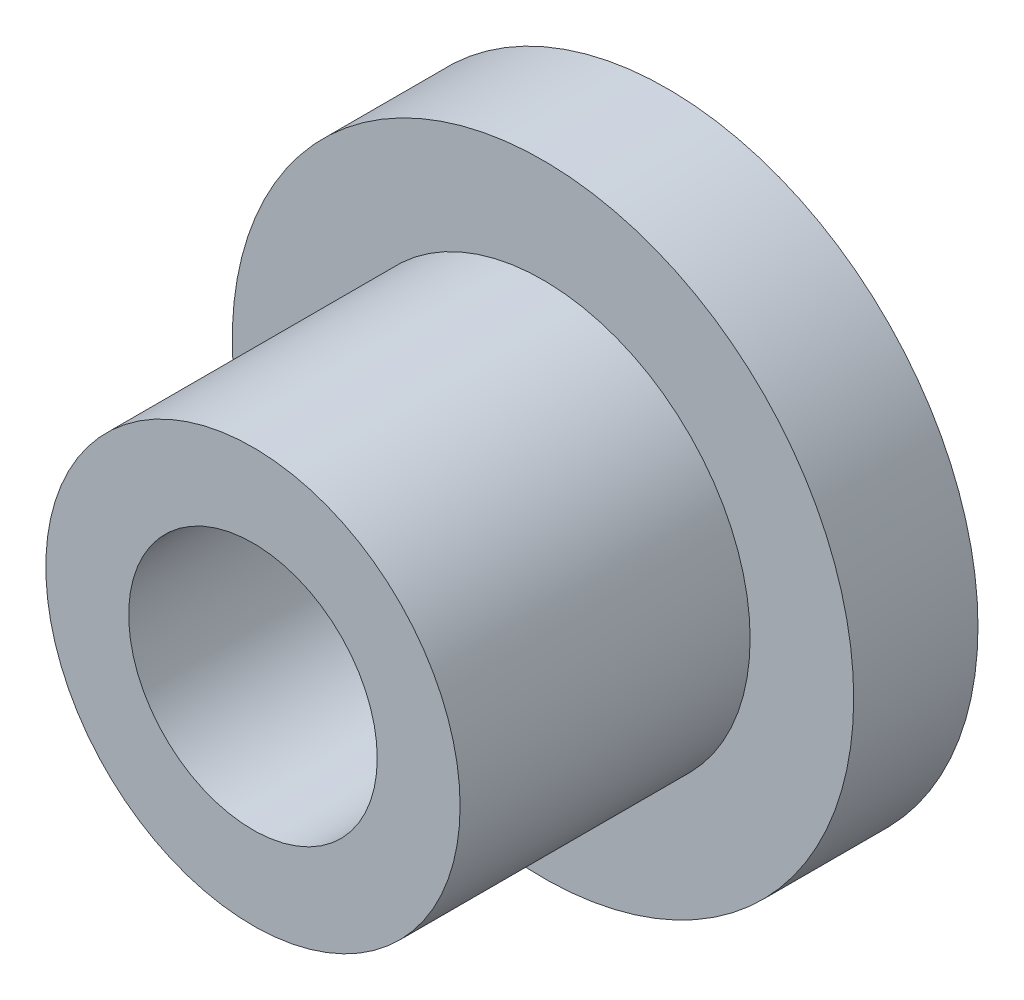
ISO-10303-21;
HEADER;
FILE_DESCRIPTION(('STEP AP214'),'2;1');
FILE_NAME('part.step','',(''),(''),'','','');
FILE_SCHEMA(('AUTOMOTIVE_DESIGN { 1 0 10303 214 1 1 1 1 }'));
ENDSEC;
DATA;
#1=APPLICATION_CONTEXT('core data for automotive mechanical design processes');
#2=APPLICATION_PROTOCOL_DEFINITION('international standard','automotive_design',2000,#1);
#3=PRODUCT_CONTEXT('',#1,'mechanical');
#4=PRODUCT('Part','Part','',(#3));
#5=PRODUCT_RELATED_PRODUCT_CATEGORY('part','',(#4));
#6=PRODUCT_DEFINITION_FORMATION('','',#4);
#7=PRODUCT_DEFINITION_CONTEXT('part definition',#1,'design');
#8=PRODUCT_DEFINITION('design','',#6,#7);
#9=PRODUCT_DEFINITION_SHAPE('','',#8);
#10=(LENGTH_UNIT() NAMED_UNIT(*) SI_UNIT(.MILLI.,.METRE.));
#11=(NAMED_UNIT(*) PLANE_ANGLE_UNIT() SI_UNIT($,.RADIAN.));
#12=(NAMED_UNIT(*) SI_UNIT($,.STERADIAN.) SOLID_ANGLE_UNIT());
#13=UNCERTAINTY_MEASURE_WITH_UNIT(LENGTH_MEASURE(1.E-05),#10,'distance_accuracy_value','');
#14=(GEOMETRIC_REPRESENTATION_CONTEXT(3) GLOBAL_UNCERTAINTY_ASSIGNED_CONTEXT((#13)) GLOBAL_UNIT_ASSIGNED_CONTEXT((#10,
#11,#12)) REPRESENTATION_CONTEXT('',''));
#15=CARTESIAN_POINT('',(0.,0.,0.));
#16=DIRECTION('',(0.,0.,1.));
#17=DIRECTION('',(1.,0.,0.));
#18=AXIS2_PLACEMENT_3D('',#15,#16,#17);
#19=CARTESIAN_POINT('',(0.,0.,6.));
#20=DIRECTION('',(0.,0.,-1.));
#21=DIRECTION('',(-1.,0.,0.));
#22=AXIS2_PLACEMENT_3D('',#19,#20,#21);
#23=CYLINDRICAL_SURFACE('',#22,15.);
#24=CARTESIAN_POINT('',(0.,0.,6.));
#25=DIRECTION('',(0.,0.,1.));
#26=DIRECTION('',(1.,0.,0.));
#27=AXIS2_PLACEMENT_3D('',#24,#25,#26);
#28=CIRCLE('',#27,15.);
#29=CARTESIAN_POINT('',(15.,0.,6.));
#30=VERTEX_POINT('',#29);
#31=EDGE_CURVE('E49',#30,#30,#28,.T.);
#32=ORIENTED_EDGE('',*,*,#31,.F.);
#33=EDGE_LOOP('',(#32));
#34=FACE_BOUND('',#33,.T.);
#35=CARTESIAN_POINT('',(0.,0.,0.));
#36=DIRECTION('',(0.,0.,1.));
#37=DIRECTION('',(1.,0.,0.));
#38=AXIS2_PLACEMENT_3D('',#35,#36,#37);
#39=CIRCLE('',#38,15.);
#40=CARTESIAN_POINT('',(15.,0.,0.));
#41=VERTEX_POINT('',#40);
#42=EDGE_CURVE('E44',#41,#41,#39,.T.);
#43=ORIENTED_EDGE('',*,*,#42,.T.);
#44=EDGE_LOOP('',(#43));
#45=FACE_BOUND('',#44,.T.);
#46=ADVANCED_FACE('F41',(#34,#45),#23,.T.);
#47=CARTESIAN_POINT('',(0.,0.,6.));
#48=DIRECTION('',(0.,0.,1.));
#49=DIRECTION('',(1.,0.,0.));
#50=AXIS2_PLACEMENT_3D('',#47,#48,#49);
#51=PLANE('',#50);
#52=CARTESIAN_POINT('',(0.,0.,6.));
#53=DIRECTION('',(0.,0.,1.));
#54=DIRECTION('',(1.,0.,0.));
#55=AXIS2_PLACEMENT_3D('',#52,#53,#54);
#56=CIRCLE('',#55,10.);
#57=CARTESIAN_POINT('',(10.,0.,6.));
#58=VERTEX_POINT('',#57);
#59=EDGE_CURVE('E10',#58,#58,#56,.T.);
#60=ORIENTED_EDGE('',*,*,#59,.F.);
#61=EDGE_LOOP('',(#60));
#62=FACE_BOUND('',#61,.T.);
#63=ORIENTED_EDGE('',*,*,#31,.T.);
#64=EDGE_LOOP('',(#63));
#65=FACE_BOUND('',#64,.T.);
#66=ADVANCED_FACE('F90',(#62,#65),#51,.T.);
#67=CARTESIAN_POINT('',(0.,0.,0.));
#68=DIRECTION('',(0.,0.,1.));
#69=DIRECTION('',(1.,0.,0.));
#70=AXIS2_PLACEMENT_3D('',#67,#68,#69);
#71=PLANE('',#70);
#72=CARTESIAN_POINT('',(0.,0.,0.));
#73=DIRECTION('',(0.,0.,1.));
#74=DIRECTION('',(1.,0.,0.));
#75=AXIS2_PLACEMENT_3D('',#72,#73,#74);
#76=CIRCLE('',#75,6.);
#77=CARTESIAN_POINT('',(6.,0.,0.));
#78=VERTEX_POINT('',#77);
#79=EDGE_CURVE('E60',#78,#78,#76,.T.);
#80=ORIENTED_EDGE('',*,*,#79,.T.);
#81=EDGE_LOOP('',(#80));
#82=FACE_BOUND('',#81,.T.);
#83=ORIENTED_EDGE('',*,*,#42,.F.);
#84=EDGE_LOOP('',(#83));
#85=FACE_BOUND('',#84,.T.);
#86=ADVANCED_FACE('F69',(#82,#85),#71,.F.);
#87=CARTESIAN_POINT('',(0.,0.,20.));
#88=DIRECTION('',(0.,0.,-1.));
#89=DIRECTION('',(-1.,0.,0.));
#90=AXIS2_PLACEMENT_3D('',#87,#88,#89);
#91=CYLINDRICAL_SURFACE('',#90,10.);
#92=CARTESIAN_POINT('',(0.,0.,20.));
#93=DIRECTION('',(0.,0.,1.));
#94=DIRECTION('',(1.,0.,0.));
#95=AXIS2_PLACEMENT_3D('',#92,#93,#94);
#96=CIRCLE('',#95,10.);
#97=CARTESIAN_POINT('',(10.,0.,20.));
#98=VERTEX_POINT('',#97);
#99=EDGE_CURVE('E56',#98,#98,#96,.T.);
#100=ORIENTED_EDGE('',*,*,#99,.F.);
#101=EDGE_LOOP('',(#100));
#102=FACE_BOUND('',#101,.T.);
#103=ORIENTED_EDGE('',*,*,#59,.T.);
#104=EDGE_LOOP('',(#103));
#105=FACE_BOUND('',#104,.T.);
#106=ADVANCED_FACE('F81',(#102,#105),#91,.T.);
#107=CARTESIAN_POINT('',(0.,0.,20.));
#108=DIRECTION('',(0.,0.,1.));
#109=DIRECTION('',(1.,0.,0.));
#110=AXIS2_PLACEMENT_3D('',#107,#108,#109);
#111=PLANE('',#110);
#112=CARTESIAN_POINT('',(0.,0.,20.));
#113=DIRECTION('',(0.,0.,1.));
#114=DIRECTION('',(1.,0.,0.));
#115=AXIS2_PLACEMENT_3D('',#112,#113,#114);
#116=CIRCLE('',#115,6.);
#117=CARTESIAN_POINT('',(6.,0.,20.));
#118=VERTEX_POINT('',#117);
#119=EDGE_CURVE('E61',#118,#118,#116,.T.);
#120=ORIENTED_EDGE('',*,*,#119,.F.);
#121=EDGE_LOOP('',(#120));
#122=FACE_BOUND('',#121,.T.);
#123=ORIENTED_EDGE('',*,*,#99,.T.);
#124=EDGE_LOOP('',(#123));
#125=FACE_BOUND('',#124,.T.);
#126=ADVANCED_FACE('F75',(#122,#125),#111,.T.);
#127=CARTESIAN_POINT('',(0.,0.,0.));
#128=DIRECTION('',(0.,0.,1.));
#129=DIRECTION('',(1.,0.,0.));
#130=AXIS2_PLACEMENT_3D('',#127,#128,#129);
#131=CYLINDRICAL_SURFACE('',#130,6.);
#132=ORIENTED_EDGE('',*,*,#79,.F.);
#133=EDGE_LOOP('',(#132));
#134=FACE_BOUND('',#133,.T.);
#135=ORIENTED_EDGE('',*,*,#119,.T.);
#136=EDGE_LOOP('',(#135));
#137=FACE_BOUND('',#136,.T.);
#138=ADVANCED_FACE('F72',(#134,#137),#131,.F.);
#139=CLOSED_SHELL('',(#46,#66,#86,#106,#126,#138));
#140=MANIFOLD_SOLID_BREP('B2',#139);
#141=ADVANCED_BREP_SHAPE_REPRESENTATION('',(#18,#140),#14);
#142=SHAPE_DEFINITION_REPRESENTATION(#9,#141);
ENDSEC;
END-ISO-10303-21;
